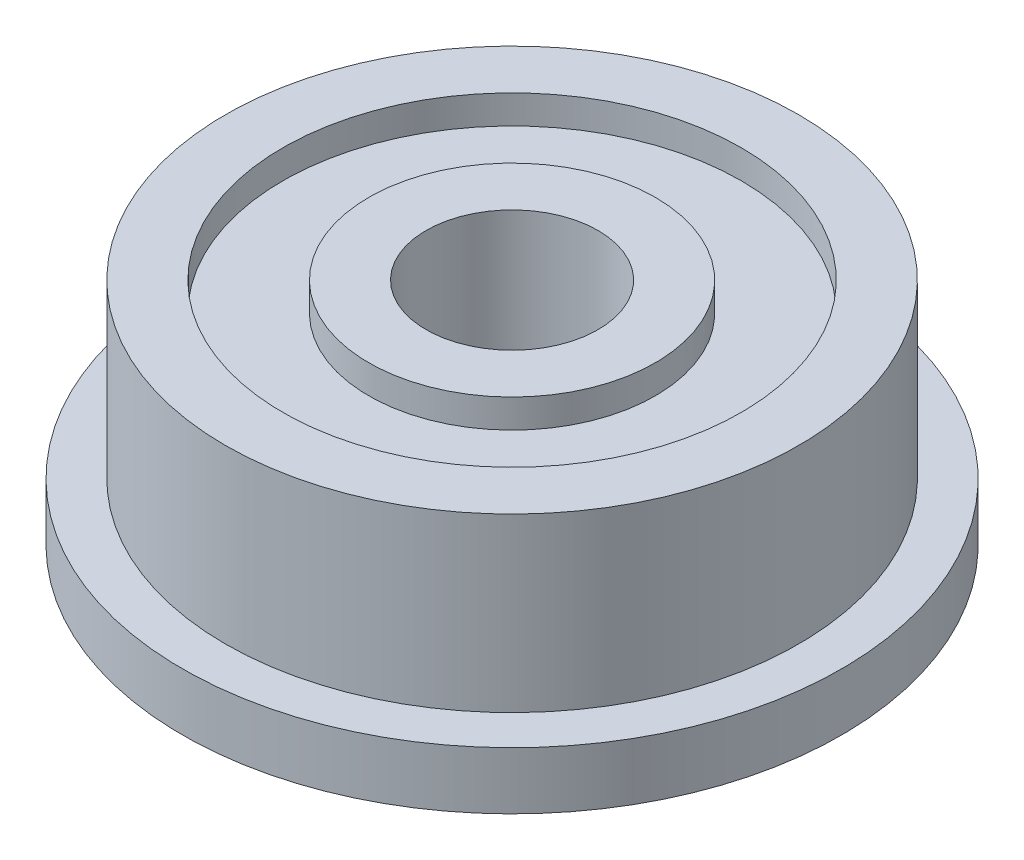
ISO-10303-21;
HEADER;
FILE_DESCRIPTION(('STEP AP214'),'2;1');
FILE_NAME('part.step','',(''),(''),'','','');
FILE_SCHEMA(('AUTOMOTIVE_DESIGN { 1 0 10303 214 1 1 1 1 }'));
ENDSEC;
DATA;
#1=APPLICATION_CONTEXT('core data for automotive mechanical design processes');
#2=APPLICATION_PROTOCOL_DEFINITION('international standard','automotive_design',2000,#1);
#3=PRODUCT_CONTEXT('',#1,'mechanical');
#4=PRODUCT('Part','Part','',(#3));
#5=PRODUCT_RELATED_PRODUCT_CATEGORY('part','',(#4));
#6=PRODUCT_DEFINITION_FORMATION('','',#4);
#7=PRODUCT_DEFINITION_CONTEXT('part definition',#1,'design');
#8=PRODUCT_DEFINITION('design','',#6,#7);
#9=PRODUCT_DEFINITION_SHAPE('','',#8);
#10=(LENGTH_UNIT() NAMED_UNIT(*) SI_UNIT(.MILLI.,.METRE.));
#11=(NAMED_UNIT(*) PLANE_ANGLE_UNIT() SI_UNIT($,.RADIAN.));
#12=(NAMED_UNIT(*) SI_UNIT($,.STERADIAN.) SOLID_ANGLE_UNIT());
#13=UNCERTAINTY_MEASURE_WITH_UNIT(LENGTH_MEASURE(1.E-05),#10,'distance_accuracy_value','');
#14=(GEOMETRIC_REPRESENTATION_CONTEXT(3) GLOBAL_UNCERTAINTY_ASSIGNED_CONTEXT((#13)) GLOBAL_UNIT_ASSIGNED_CONTEXT((#10,
#11,#12)) REPRESENTATION_CONTEXT('',''));
#15=CARTESIAN_POINT('',(0.,0.,0.));
#16=DIRECTION('',(0.,0.,1.));
#17=DIRECTION('',(1.,0.,0.));
#18=AXIS2_PLACEMENT_3D('',#15,#16,#17);
#19=CARTESIAN_POINT('',(2.5,0.,0.));
#20=DIRECTION('',(0.,-1.,0.));
#21=DIRECTION('',(0.,0.,-1.));
#22=AXIS2_PLACEMENT_3D('',#19,#20,#21);
#23=PLANE('',#22);
#24=CARTESIAN_POINT('',(0.,0.,0.));
#25=DIRECTION('',(0.,-1.,0.));
#26=DIRECTION('',(0.,0.,-1.));
#27=AXIS2_PLACEMENT_3D('',#24,#25,#26);
#28=CIRCLE('',#27,2.5);
#29=CARTESIAN_POINT('',(0.,0.,-2.5));
#30=VERTEX_POINT('',#29);
#31=EDGE_CURVE('E77',#30,#30,#28,.T.);
#32=ORIENTED_EDGE('',*,*,#31,.T.);
#33=EDGE_LOOP('',(#32));
#34=FACE_BOUND('',#33,.T.);
#35=CARTESIAN_POINT('',(0.,0.,0.));
#36=DIRECTION('',(0.,-1.,0.));
#37=DIRECTION('',(0.,0.,-1.));
#38=AXIS2_PLACEMENT_3D('',#35,#36,#37);
#39=CIRCLE('',#38,1.5);
#40=CARTESIAN_POINT('',(0.,0.,-1.5));
#41=VERTEX_POINT('',#40);
#42=EDGE_CURVE('E10',#41,#41,#39,.T.);
#43=ORIENTED_EDGE('',*,*,#42,.F.);
#44=EDGE_LOOP('',(#43));
#45=FACE_BOUND('',#44,.T.);
#46=ADVANCED_FACE('F31',(#34,#45),#23,.T.);
#47=CARTESIAN_POINT('',(0.,-20.7974953018558,0.));
#48=DIRECTION('',(0.,-1.,0.));
#49=DIRECTION('',(0.,0.,-1.));
#50=AXIS2_PLACEMENT_3D('',#47,#48,#49);
#51=CYLINDRICAL_SURFACE('',#50,1.5);
#52=ORIENTED_EDGE('',*,*,#42,.T.);
#53=EDGE_LOOP('',(#52));
#54=FACE_BOUND('',#53,.T.);
#55=CARTESIAN_POINT('',(0.,4.,0.));
#56=DIRECTION('',(0.,-1.,0.));
#57=DIRECTION('',(0.,0.,-1.));
#58=AXIS2_PLACEMENT_3D('',#55,#56,#57);
#59=CIRCLE('',#58,1.5);
#60=CARTESIAN_POINT('',(0.,4.,-1.5));
#61=VERTEX_POINT('',#60);
#62=EDGE_CURVE('E37',#61,#61,#59,.T.);
#63=ORIENTED_EDGE('',*,*,#62,.F.);
#64=EDGE_LOOP('',(#63));
#65=FACE_BOUND('',#64,.T.);
#66=ADVANCED_FACE('F95',(#54,#65),#51,.F.);
#67=CARTESIAN_POINT('',(1.5,4.,0.));
#68=DIRECTION('',(0.,1.,0.));
#69=DIRECTION('',(0.,0.,1.));
#70=AXIS2_PLACEMENT_3D('',#67,#68,#69);
#71=PLANE('',#70);
#72=ORIENTED_EDGE('',*,*,#62,.T.);
#73=EDGE_LOOP('',(#72));
#74=FACE_BOUND('',#73,.T.);
#75=CARTESIAN_POINT('',(0.,4.,0.));
#76=DIRECTION('',(0.,-1.,0.));
#77=DIRECTION('',(0.,0.,-1.));
#78=AXIS2_PLACEMENT_3D('',#75,#76,#77);
#79=CIRCLE('',#78,2.5);
#80=CARTESIAN_POINT('',(0.,4.,-2.5));
#81=VERTEX_POINT('',#80);
#82=EDGE_CURVE('E41',#81,#81,#79,.T.);
#83=ORIENTED_EDGE('',*,*,#82,.F.);
#84=EDGE_LOOP('',(#83));
#85=FACE_BOUND('',#84,.T.);
#86=ADVANCED_FACE('F99',(#74,#85),#71,.T.);
#87=CARTESIAN_POINT('',(0.,-20.7974953018558,0.));
#88=DIRECTION('',(0.,-1.,0.));
#89=DIRECTION('',(0.,0.,-1.));
#90=AXIS2_PLACEMENT_3D('',#87,#88,#89);
#91=CYLINDRICAL_SURFACE('',#90,2.5);
#92=ORIENTED_EDGE('',*,*,#82,.T.);
#93=EDGE_LOOP('',(#92));
#94=FACE_BOUND('',#93,.T.);
#95=CARTESIAN_POINT('',(0.,3.5,0.));
#96=DIRECTION('',(0.,-1.,0.));
#97=DIRECTION('',(0.,0.,-1.));
#98=AXIS2_PLACEMENT_3D('',#95,#96,#97);
#99=CIRCLE('',#98,2.5);
#100=CARTESIAN_POINT('',(0.,3.5,-2.5));
#101=VERTEX_POINT('',#100);
#102=EDGE_CURVE('E45',#101,#101,#99,.T.);
#103=ORIENTED_EDGE('',*,*,#102,.F.);
#104=EDGE_LOOP('',(#103));
#105=FACE_BOUND('',#104,.T.);
#106=ADVANCED_FACE('F103',(#94,#105),#91,.T.);
#107=CARTESIAN_POINT('',(2.5,3.5,0.));
#108=DIRECTION('',(0.,1.,0.));
#109=DIRECTION('',(0.,0.,1.));
#110=AXIS2_PLACEMENT_3D('',#107,#108,#109);
#111=PLANE('',#110);
#112=ORIENTED_EDGE('',*,*,#102,.T.);
#113=EDGE_LOOP('',(#112));
#114=FACE_BOUND('',#113,.T.);
#115=CARTESIAN_POINT('',(0.,3.5,0.));
#116=DIRECTION('',(0.,-1.,0.));
#117=DIRECTION('',(0.,0.,-1.));
#118=AXIS2_PLACEMENT_3D('',#115,#116,#117);
#119=CIRCLE('',#118,4.);
#120=CARTESIAN_POINT('',(0.,3.5,-4.));
#121=VERTEX_POINT('',#120);
#122=EDGE_CURVE('E50',#121,#121,#119,.T.);
#123=ORIENTED_EDGE('',*,*,#122,.F.);
#124=EDGE_LOOP('',(#123));
#125=FACE_BOUND('',#124,.T.);
#126=ADVANCED_FACE('F109',(#114,#125),#111,.T.);
#127=CARTESIAN_POINT('',(0.,-20.7974953018558,0.));
#128=DIRECTION('',(0.,-1.,0.));
#129=DIRECTION('',(0.,0.,-1.));
#130=AXIS2_PLACEMENT_3D('',#127,#128,#129);
#131=CYLINDRICAL_SURFACE('',#130,4.);
#132=ORIENTED_EDGE('',*,*,#122,.T.);
#133=EDGE_LOOP('',(#132));
#134=FACE_BOUND('',#133,.T.);
#135=CARTESIAN_POINT('',(0.,4.,0.));
#136=DIRECTION('',(0.,-1.,0.));
#137=DIRECTION('',(0.,0.,-1.));
#138=AXIS2_PLACEMENT_3D('',#135,#136,#137);
#139=CIRCLE('',#138,4.);
#140=CARTESIAN_POINT('',(0.,4.,-4.));
#141=VERTEX_POINT('',#140);
#142=EDGE_CURVE('E53',#141,#141,#139,.T.);
#143=ORIENTED_EDGE('',*,*,#142,.F.);
#144=EDGE_LOOP('',(#143));
#145=FACE_BOUND('',#144,.T.);
#146=ADVANCED_FACE('F113',(#134,#145),#131,.F.);
#147=CARTESIAN_POINT('',(4.,4.,0.));
#148=DIRECTION('',(0.,1.,0.));
#149=DIRECTION('',(0.,0.,1.));
#150=AXIS2_PLACEMENT_3D('',#147,#148,#149);
#151=PLANE('',#150);
#152=ORIENTED_EDGE('',*,*,#142,.T.);
#153=EDGE_LOOP('',(#152));
#154=FACE_BOUND('',#153,.T.);
#155=CARTESIAN_POINT('',(0.,4.,0.));
#156=DIRECTION('',(0.,-1.,0.));
#157=DIRECTION('',(0.,0.,-1.));
#158=AXIS2_PLACEMENT_3D('',#155,#156,#157);
#159=CIRCLE('',#158,5.);
#160=CARTESIAN_POINT('',(0.,4.,-5.));
#161=VERTEX_POINT('',#160);
#162=EDGE_CURVE('E56',#161,#161,#159,.T.);
#163=ORIENTED_EDGE('',*,*,#162,.F.);
#164=EDGE_LOOP('',(#163));
#165=FACE_BOUND('',#164,.T.);
#166=ADVANCED_FACE('F117',(#154,#165),#151,.T.);
#167=CARTESIAN_POINT('',(0.,-20.7974953018558,0.));
#168=DIRECTION('',(0.,-1.,0.));
#169=DIRECTION('',(0.,0.,-1.));
#170=AXIS2_PLACEMENT_3D('',#167,#168,#169);
#171=CYLINDRICAL_SURFACE('',#170,5.);
#172=ORIENTED_EDGE('',*,*,#162,.T.);
#173=EDGE_LOOP('',(#172));
#174=FACE_BOUND('',#173,.T.);
#175=CARTESIAN_POINT('',(0.,1.,0.));
#176=DIRECTION('',(0.,-1.,0.));
#177=DIRECTION('',(0.,0.,-1.));
#178=AXIS2_PLACEMENT_3D('',#175,#176,#177);
#179=CIRCLE('',#178,5.);
#180=CARTESIAN_POINT('',(0.,1.,-5.));
#181=VERTEX_POINT('',#180);
#182=EDGE_CURVE('E59',#181,#181,#179,.T.);
#183=ORIENTED_EDGE('',*,*,#182,.F.);
#184=EDGE_LOOP('',(#183));
#185=FACE_BOUND('',#184,.T.);
#186=ADVANCED_FACE('F121',(#174,#185),#171,.T.);
#187=CARTESIAN_POINT('',(5.,1.,0.));
#188=DIRECTION('',(0.,1.,0.));
#189=DIRECTION('',(0.,0.,1.));
#190=AXIS2_PLACEMENT_3D('',#187,#188,#189);
#191=PLANE('',#190);
#192=ORIENTED_EDGE('',*,*,#182,.T.);
#193=EDGE_LOOP('',(#192));
#194=FACE_BOUND('',#193,.T.);
#195=CARTESIAN_POINT('',(0.,1.,0.));
#196=DIRECTION('',(0.,-1.,0.));
#197=DIRECTION('',(0.,0.,-1.));
#198=AXIS2_PLACEMENT_3D('',#195,#196,#197);
#199=CIRCLE('',#198,5.75);
#200=CARTESIAN_POINT('',(0.,1.,-5.75));
#201=VERTEX_POINT('',#200);
#202=EDGE_CURVE('E62',#201,#201,#199,.T.);
#203=ORIENTED_EDGE('',*,*,#202,.F.);
#204=EDGE_LOOP('',(#203));
#205=FACE_BOUND('',#204,.T.);
#206=ADVANCED_FACE('F125',(#194,#205),#191,.T.);
#207=CARTESIAN_POINT('',(0.,-20.7974953018558,0.));
#208=DIRECTION('',(0.,-1.,0.));
#209=DIRECTION('',(0.,0.,-1.));
#210=AXIS2_PLACEMENT_3D('',#207,#208,#209);
#211=CYLINDRICAL_SURFACE('',#210,5.75);
#212=ORIENTED_EDGE('',*,*,#202,.T.);
#213=EDGE_LOOP('',(#212));
#214=FACE_BOUND('',#213,.T.);
#215=CARTESIAN_POINT('',(0.,0.,0.));
#216=DIRECTION('',(0.,-1.,0.));
#217=DIRECTION('',(0.,0.,-1.));
#218=AXIS2_PLACEMENT_3D('',#215,#216,#217);
#219=CIRCLE('',#218,5.75);
#220=CARTESIAN_POINT('',(0.,0.,-5.75));
#221=VERTEX_POINT('',#220);
#222=EDGE_CURVE('E65',#221,#221,#219,.T.);
#223=ORIENTED_EDGE('',*,*,#222,.F.);
#224=EDGE_LOOP('',(#223));
#225=FACE_BOUND('',#224,.T.);
#226=ADVANCED_FACE('F129',(#214,#225),#211,.T.);
#227=CARTESIAN_POINT('',(5.75,0.,0.));
#228=DIRECTION('',(0.,-1.,0.));
#229=DIRECTION('',(0.,0.,-1.));
#230=AXIS2_PLACEMENT_3D('',#227,#228,#229);
#231=PLANE('',#230);
#232=ORIENTED_EDGE('',*,*,#222,.T.);
#233=EDGE_LOOP('',(#232));
#234=FACE_BOUND('',#233,.T.);
#235=CARTESIAN_POINT('',(0.,0.,0.));
#236=DIRECTION('',(0.,-1.,0.));
#237=DIRECTION('',(0.,0.,-1.));
#238=AXIS2_PLACEMENT_3D('',#235,#236,#237);
#239=CIRCLE('',#238,4.);
#240=CARTESIAN_POINT('',(0.,0.,-4.));
#241=VERTEX_POINT('',#240);
#242=EDGE_CURVE('E68',#241,#241,#239,.T.);
#243=ORIENTED_EDGE('',*,*,#242,.F.);
#244=EDGE_LOOP('',(#243));
#245=FACE_BOUND('',#244,.T.);
#246=ADVANCED_FACE('F133',(#234,#245),#231,.T.);
#247=CARTESIAN_POINT('',(0.,-20.7974953018558,0.));
#248=DIRECTION('',(0.,-1.,0.));
#249=DIRECTION('',(0.,0.,-1.));
#250=AXIS2_PLACEMENT_3D('',#247,#248,#249);
#251=CYLINDRICAL_SURFACE('',#250,4.);
#252=ORIENTED_EDGE('',*,*,#242,.T.);
#253=EDGE_LOOP('',(#252));
#254=FACE_BOUND('',#253,.T.);
#255=CARTESIAN_POINT('',(0.,0.5,0.));
#256=DIRECTION('',(0.,-1.,0.));
#257=DIRECTION('',(0.,0.,-1.));
#258=AXIS2_PLACEMENT_3D('',#255,#256,#257);
#259=CIRCLE('',#258,4.);
#260=CARTESIAN_POINT('',(0.,0.5,-4.));
#261=VERTEX_POINT('',#260);
#262=EDGE_CURVE('E71',#261,#261,#259,.T.);
#263=ORIENTED_EDGE('',*,*,#262,.F.);
#264=EDGE_LOOP('',(#263));
#265=FACE_BOUND('',#264,.T.);
#266=ADVANCED_FACE('F91',(#254,#265),#251,.F.);
#267=CARTESIAN_POINT('',(2.5,0.5,0.));
#268=DIRECTION('',(0.,-1.,0.));
#269=DIRECTION('',(0.,0.,-1.));
#270=AXIS2_PLACEMENT_3D('',#267,#268,#269);
#271=PLANE('',#270);
#272=ORIENTED_EDGE('',*,*,#262,.T.);
#273=EDGE_LOOP('',(#272));
#274=FACE_BOUND('',#273,.T.);
#275=CARTESIAN_POINT('',(0.,0.5,0.));
#276=DIRECTION('',(0.,-1.,0.));
#277=DIRECTION('',(0.,0.,-1.));
#278=AXIS2_PLACEMENT_3D('',#275,#276,#277);
#279=CIRCLE('',#278,2.5);
#280=CARTESIAN_POINT('',(0.,0.5,-2.5));
#281=VERTEX_POINT('',#280);
#282=EDGE_CURVE('E74',#281,#281,#279,.T.);
#283=ORIENTED_EDGE('',*,*,#282,.F.);
#284=EDGE_LOOP('',(#283));
#285=FACE_BOUND('',#284,.T.);
#286=ADVANCED_FACE('F85',(#274,#285),#271,.T.);
#287=CARTESIAN_POINT('',(0.,-20.7974953018558,0.));
#288=DIRECTION('',(0.,-1.,0.));
#289=DIRECTION('',(0.,0.,-1.));
#290=AXIS2_PLACEMENT_3D('',#287,#288,#289);
#291=CYLINDRICAL_SURFACE('',#290,2.5);
#292=ORIENTED_EDGE('',*,*,#282,.T.);
#293=EDGE_LOOP('',(#292));
#294=FACE_BOUND('',#293,.T.);
#295=ORIENTED_EDGE('',*,*,#31,.F.);
#296=EDGE_LOOP('',(#295));
#297=FACE_BOUND('',#296,.T.);
#298=ADVANCED_FACE('F83',(#294,#297),#291,.T.);
#299=CLOSED_SHELL('',(#46,#66,#86,#106,#126,#146,#166,#186,#206,#226,#246,#266,#286,#298));
#300=MANIFOLD_SOLID_BREP('B2',#299);
#301=ADVANCED_BREP_SHAPE_REPRESENTATION('',(#18,#300),#14);
#302=SHAPE_DEFINITION_REPRESENTATION(#9,#301);
ENDSEC;
END-ISO-10303-21;
